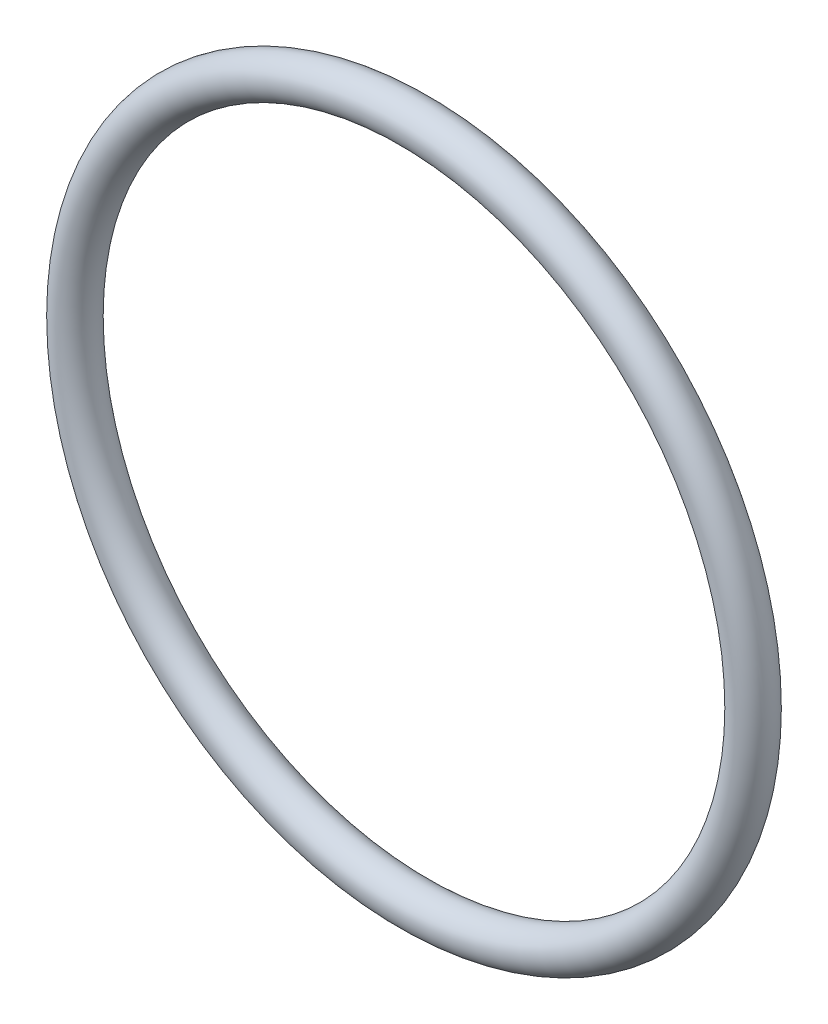
ISO-10303-21;
HEADER;
FILE_DESCRIPTION(('STEP AP214'),'2;1');
FILE_NAME('part.step','',(''),(''),'','','');
FILE_SCHEMA(('AUTOMOTIVE_DESIGN { 1 0 10303 214 1 1 1 1 }'));
ENDSEC;
DATA;
#1=APPLICATION_CONTEXT('core data for automotive mechanical design processes');
#2=APPLICATION_PROTOCOL_DEFINITION('international standard','automotive_design',2000,#1);
#3=PRODUCT_CONTEXT('',#1,'mechanical');
#4=PRODUCT('Part','Part','',(#3));
#5=PRODUCT_RELATED_PRODUCT_CATEGORY('part','',(#4));
#6=PRODUCT_DEFINITION_FORMATION('','',#4);
#7=PRODUCT_DEFINITION_CONTEXT('part definition',#1,'design');
#8=PRODUCT_DEFINITION('design','',#6,#7);
#9=PRODUCT_DEFINITION_SHAPE('','',#8);
#10=(LENGTH_UNIT() NAMED_UNIT(*) SI_UNIT(.MILLI.,.METRE.));
#11=(NAMED_UNIT(*) PLANE_ANGLE_UNIT() SI_UNIT($,.RADIAN.));
#12=(NAMED_UNIT(*) SI_UNIT($,.STERADIAN.) SOLID_ANGLE_UNIT());
#13=UNCERTAINTY_MEASURE_WITH_UNIT(LENGTH_MEASURE(1.E-05),#10,'distance_accuracy_value','');
#14=(GEOMETRIC_REPRESENTATION_CONTEXT(3) GLOBAL_UNCERTAINTY_ASSIGNED_CONTEXT((#13)) GLOBAL_UNIT_ASSIGNED_CONTEXT((#10,
#11,#12)) REPRESENTATION_CONTEXT('',''));
#15=CARTESIAN_POINT('',(0.,0.,0.));
#16=DIRECTION('',(0.,0.,1.));
#17=DIRECTION('',(1.,0.,0.));
#18=AXIS2_PLACEMENT_3D('',#15,#16,#17);
#19=CARTESIAN_POINT('',(0.,0.,0.));
#20=DIRECTION('',(0.,0.,1.));
#21=DIRECTION('',(1.,0.,0.));
#22=AXIS2_PLACEMENT_3D('',#19,#20,#21);
#23=TOROIDAL_SURFACE('',#22,45.212,2.667);
#24=CARTESIAN_POINT('',(47.879,0.,0.));
#25=VERTEX_POINT('',#24);
#26=VERTEX_LOOP('',#25);
#27=FACE_BOUND('',#26,.T.);
#28=ADVANCED_FACE('F28',(#27),#23,.T.);
#29=CLOSED_SHELL('',(#28));
#30=MANIFOLD_SOLID_BREP('B2',#29);
#31=ADVANCED_BREP_SHAPE_REPRESENTATION('',(#18,#30),#14);
#32=SHAPE_DEFINITION_REPRESENTATION(#9,#31);
ENDSEC;
END-ISO-10303-21;
